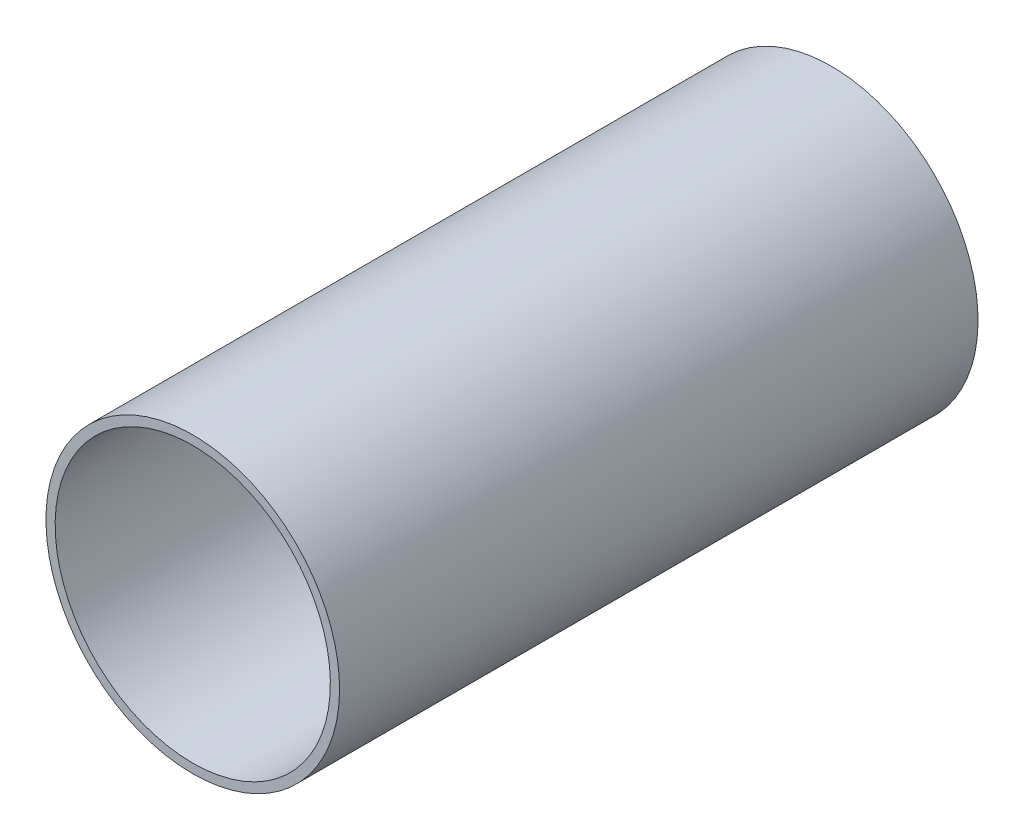
ISO-10303-21;
HEADER;
FILE_DESCRIPTION(('STEP AP214'),'2;1');
FILE_NAME('part.step','',(''),(''),'','','');
FILE_SCHEMA(('AUTOMOTIVE_DESIGN { 1 0 10303 214 1 1 1 1 }'));
ENDSEC;
DATA;
#1=APPLICATION_CONTEXT('core data for automotive mechanical design processes');
#2=APPLICATION_PROTOCOL_DEFINITION('international standard','automotive_design',2000,#1);
#3=PRODUCT_CONTEXT('',#1,'mechanical');
#4=PRODUCT('Part','Part','',(#3));
#5=PRODUCT_RELATED_PRODUCT_CATEGORY('part','',(#4));
#6=PRODUCT_DEFINITION_FORMATION('','',#4);
#7=PRODUCT_DEFINITION_CONTEXT('part definition',#1,'design');
#8=PRODUCT_DEFINITION('design','',#6,#7);
#9=PRODUCT_DEFINITION_SHAPE('','',#8);
#10=(LENGTH_UNIT() NAMED_UNIT(*) SI_UNIT(.MILLI.,.METRE.));
#11=(NAMED_UNIT(*) PLANE_ANGLE_UNIT() SI_UNIT($,.RADIAN.));
#12=(NAMED_UNIT(*) SI_UNIT($,.STERADIAN.) SOLID_ANGLE_UNIT());
#13=UNCERTAINTY_MEASURE_WITH_UNIT(LENGTH_MEASURE(1.E-05),#10,'distance_accuracy_value','');
#14=(GEOMETRIC_REPRESENTATION_CONTEXT(3) GLOBAL_UNCERTAINTY_ASSIGNED_CONTEXT((#13)) GLOBAL_UNIT_ASSIGNED_CONTEXT((#10,
#11,#12)) REPRESENTATION_CONTEXT('',''));
#15=CARTESIAN_POINT('',(0.,0.,0.));
#16=DIRECTION('',(0.,0.,1.));
#17=DIRECTION('',(1.,0.,0.));
#18=AXIS2_PLACEMENT_3D('',#15,#16,#17);
#19=CARTESIAN_POINT('',(176.276,-105.664,-0.045));
#20=DIRECTION('',(0.,0.,-1.));
#21=DIRECTION('',(0.,-1.,0.));
#22=AXIS2_PLACEMENT_3D('',#19,#20,#21);
#23=CYLINDRICAL_SURFACE('',#22,0.375);
#24=CARTESIAN_POINT('',(176.276,-105.664,-0.035));
#25=DIRECTION('',(0.,0.,-1.));
#26=DIRECTION('',(0.,-1.,0.));
#27=AXIS2_PLACEMENT_3D('',#24,#25,#26);
#28=CIRCLE('',#27,0.375);
#29=CARTESIAN_POINT('',(176.276,-106.039,-0.035));
#30=VERTEX_POINT('',#29);
#31=EDGE_CURVE('E64',#30,#30,#28,.T.);
#32=ORIENTED_EDGE('',*,*,#31,.T.);
#33=DIRECTION('',(0.,0.,1.));
#34=VECTOR('',#33,1.);
#35=CARTESIAN_POINT('',(176.276,-106.039,-0.045));
#36=LINE('',#35,#34);
#37=CARTESIAN_POINT('',(176.276,-106.039,1.705));
#38=VERTEX_POINT('',#37);
#39=EDGE_CURVE('E11',#30,#38,#36,.T.);
#40=ORIENTED_EDGE('',*,*,#39,.T.);
#41=CARTESIAN_POINT('',(176.276,-105.664,1.705));
#42=DIRECTION('',(0.,0.,-1.));
#43=DIRECTION('',(0.,-1.,0.));
#44=AXIS2_PLACEMENT_3D('',#41,#42,#43);
#45=CIRCLE('',#44,0.375);
#46=EDGE_CURVE('E26',#38,#38,#45,.T.);
#47=ORIENTED_EDGE('',*,*,#46,.F.);
#48=ORIENTED_EDGE('',*,*,#39,.F.);
#49=EDGE_LOOP('',(#32,#40,#47,#48));
#50=FACE_BOUND('',#49,.T.);
#51=ADVANCED_FACE('F17',(#50),#23,.F.);
#52=CARTESIAN_POINT('',(176.276,-106.064,1.705));
#53=DIRECTION('',(0.,0.,1.));
#54=DIRECTION('',(1.,0.,0.));
#55=AXIS2_PLACEMENT_3D('',#52,#53,#54);
#56=PLANE('',#55);
#57=ORIENTED_EDGE('',*,*,#46,.T.);
#58=EDGE_LOOP('',(#57));
#59=FACE_BOUND('',#58,.T.);
#60=CARTESIAN_POINT('',(176.276,-105.664,1.705));
#61=DIRECTION('',(0.,0.,1.));
#62=DIRECTION('',(0.,-1.,0.));
#63=AXIS2_PLACEMENT_3D('',#60,#61,#62);
#64=CIRCLE('',#63,0.4);
#65=CARTESIAN_POINT('',(176.276,-106.064,1.705));
#66=VERTEX_POINT('',#65);
#67=EDGE_CURVE('E46',#66,#66,#64,.T.);
#68=ORIENTED_EDGE('',*,*,#67,.T.);
#69=EDGE_LOOP('',(#68));
#70=FACE_BOUND('',#69,.T.);
#71=ADVANCED_FACE('F73',(#59,#70),#56,.T.);
#72=CARTESIAN_POINT('',(176.276,-106.064,-0.035));
#73=DIRECTION('',(0.,0.,1.));
#74=DIRECTION('',(1.,0.,0.));
#75=AXIS2_PLACEMENT_3D('',#72,#73,#74);
#76=PLANE('',#75);
#77=ORIENTED_EDGE('',*,*,#31,.F.);
#78=EDGE_LOOP('',(#77));
#79=FACE_BOUND('',#78,.T.);
#80=CARTESIAN_POINT('',(176.276,-105.664,-0.035));
#81=DIRECTION('',(0.,0.,1.));
#82=DIRECTION('',(0.,-1.,0.));
#83=AXIS2_PLACEMENT_3D('',#80,#81,#82);
#84=CIRCLE('',#83,0.4);
#85=CARTESIAN_POINT('',(176.276,-106.064,-0.035));
#86=VERTEX_POINT('',#85);
#87=EDGE_CURVE('E56',#86,#86,#84,.T.);
#88=ORIENTED_EDGE('',*,*,#87,.F.);
#89=EDGE_LOOP('',(#88));
#90=FACE_BOUND('',#89,.T.);
#91=ADVANCED_FACE('F76',(#79,#90),#76,.F.);
#92=CARTESIAN_POINT('',(176.276,-105.664,-0.035));
#93=DIRECTION('',(0.,0.,-1.));
#94=DIRECTION('',(0.,-1.,0.));
#95=AXIS2_PLACEMENT_3D('',#92,#93,#94);
#96=CYLINDRICAL_SURFACE('',#95,0.4);
#97=ORIENTED_EDGE('',*,*,#87,.T.);
#98=DIRECTION('',(0.,0.,1.));
#99=VECTOR('',#98,1.);
#100=CARTESIAN_POINT('',(176.276,-106.064,-0.035));
#101=LINE('',#100,#99);
#102=EDGE_CURVE('E53',#86,#66,#101,.T.);
#103=ORIENTED_EDGE('',*,*,#102,.T.);
#104=ORIENTED_EDGE('',*,*,#67,.F.);
#105=ORIENTED_EDGE('',*,*,#102,.F.);
#106=EDGE_LOOP('',(#97,#103,#104,#105));
#107=FACE_BOUND('',#106,.T.);
#108=ADVANCED_FACE('F54',(#107),#96,.T.);
#109=CLOSED_SHELL('',(#51,#71,#91,#108));
#110=MANIFOLD_SOLID_BREP('B1',#109);
#111=ADVANCED_BREP_SHAPE_REPRESENTATION('',(#18,#110),#14);
#112=SHAPE_DEFINITION_REPRESENTATION(#9,#111);
ENDSEC;
END-ISO-10303-21;
